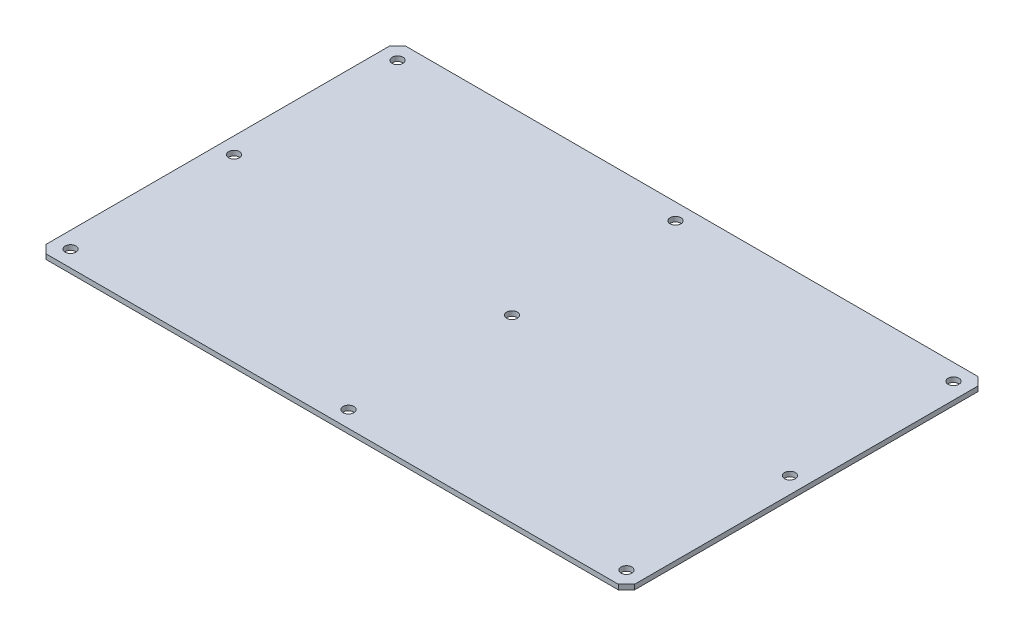
ISO-10303-21;
HEADER;
FILE_DESCRIPTION(('STEP AP214'),'2;1');
FILE_NAME('part.step','',(''),(''),'','','');
FILE_SCHEMA(('AUTOMOTIVE_DESIGN { 1 0 10303 214 1 1 1 1 }'));
ENDSEC;
DATA;
#1=APPLICATION_CONTEXT('core data for automotive mechanical design processes');
#2=APPLICATION_PROTOCOL_DEFINITION('international standard','automotive_design',2000,#1);
#3=PRODUCT_CONTEXT('',#1,'mechanical');
#4=PRODUCT('Part','Part','',(#3));
#5=PRODUCT_RELATED_PRODUCT_CATEGORY('part','',(#4));
#6=PRODUCT_DEFINITION_FORMATION('','',#4);
#7=PRODUCT_DEFINITION_CONTEXT('part definition',#1,'design');
#8=PRODUCT_DEFINITION('design','',#6,#7);
#9=PRODUCT_DEFINITION_SHAPE('','',#8);
#10=(LENGTH_UNIT() NAMED_UNIT(*) SI_UNIT(.MILLI.,.METRE.));
#11=(NAMED_UNIT(*) PLANE_ANGLE_UNIT() SI_UNIT($,.RADIAN.));
#12=(NAMED_UNIT(*) SI_UNIT($,.STERADIAN.) SOLID_ANGLE_UNIT());
#13=UNCERTAINTY_MEASURE_WITH_UNIT(LENGTH_MEASURE(1.E-05),#10,'distance_accuracy_value','');
#14=(GEOMETRIC_REPRESENTATION_CONTEXT(3) GLOBAL_UNCERTAINTY_ASSIGNED_CONTEXT((#13)) GLOBAL_UNIT_ASSIGNED_CONTEXT((#10,
#11,#12)) REPRESENTATION_CONTEXT('',''));
#15=CARTESIAN_POINT('',(0.,0.,0.));
#16=DIRECTION('',(0.,0.,1.));
#17=DIRECTION('',(1.,0.,0.));
#18=AXIS2_PLACEMENT_3D('',#15,#16,#17);
#19=CARTESIAN_POINT('',(180.,3.,-110.));
#20=DIRECTION('',(-1.,0.,0.));
#21=DIRECTION('',(0.,0.,1.));
#22=AXIS2_PLACEMENT_3D('',#19,#20,#21);
#23=PLANE('',#22);
#24=DIRECTION('',(0.,0.,-1.));
#25=VECTOR('',#24,1.);
#26=CARTESIAN_POINT('',(180.,3.,-110.));
#27=LINE('',#26,#25);
#28=CARTESIAN_POINT('',(180.,3.,105.));
#29=VERTEX_POINT('',#28);
#30=CARTESIAN_POINT('',(180.,3.,-105.));
#31=VERTEX_POINT('',#30);
#32=EDGE_CURVE('E126',#29,#31,#27,.T.);
#33=ORIENTED_EDGE('',*,*,#32,.F.);
#34=DIRECTION('',(0.,-1.,0.));
#35=VECTOR('',#34,1.);
#36=CARTESIAN_POINT('',(180.,3.,105.));
#37=LINE('',#36,#35);
#38=CARTESIAN_POINT('',(180.,0.,105.));
#39=VERTEX_POINT('',#38);
#40=EDGE_CURVE('E152',#29,#39,#37,.T.);
#41=ORIENTED_EDGE('',*,*,#40,.T.);
#42=DIRECTION('',(0.,0.,-1.));
#43=VECTOR('',#42,1.);
#44=CARTESIAN_POINT('',(180.,0.,-110.));
#45=LINE('',#44,#43);
#46=CARTESIAN_POINT('',(180.,0.,-105.));
#47=VERTEX_POINT('',#46);
#48=EDGE_CURVE('E158',#39,#47,#45,.T.);
#49=ORIENTED_EDGE('',*,*,#48,.T.);
#50=DIRECTION('',(0.,1.,0.));
#51=VECTOR('',#50,1.);
#52=CARTESIAN_POINT('',(180.,3.,-105.));
#53=LINE('',#52,#51);
#54=EDGE_CURVE('E150',#47,#31,#53,.T.);
#55=ORIENTED_EDGE('',*,*,#54,.T.);
#56=EDGE_LOOP('',(#33,#41,#49,#55));
#57=FACE_BOUND('',#56,.T.);
#58=ADVANCED_FACE('F34',(#57),#23,.F.);
#59=CARTESIAN_POINT('',(180.,3.,-110.));
#60=DIRECTION('',(0.,0.,1.));
#61=DIRECTION('',(1.,0.,0.));
#62=AXIS2_PLACEMENT_3D('',#59,#60,#61);
#63=PLANE('',#62);
#64=DIRECTION('',(-1.,0.,0.));
#65=VECTOR('',#64,1.);
#66=CARTESIAN_POINT('',(180.,3.,-110.));
#67=LINE('',#66,#65);
#68=CARTESIAN_POINT('',(175.,3.,-110.));
#69=VERTEX_POINT('',#68);
#70=CARTESIAN_POINT('',(-175.,3.,-110.));
#71=VERTEX_POINT('',#70);
#72=EDGE_CURVE('E129',#69,#71,#67,.T.);
#73=ORIENTED_EDGE('',*,*,#72,.F.);
#74=DIRECTION('',(0.,-1.,0.));
#75=VECTOR('',#74,1.);
#76=CARTESIAN_POINT('',(175.,3.,-110.));
#77=LINE('',#76,#75);
#78=CARTESIAN_POINT('',(175.,0.,-110.));
#79=VERTEX_POINT('',#78);
#80=EDGE_CURVE('E11',#69,#79,#77,.T.);
#81=ORIENTED_EDGE('',*,*,#80,.T.);
#82=DIRECTION('',(-1.,0.,0.));
#83=VECTOR('',#82,1.);
#84=CARTESIAN_POINT('',(180.,0.,-110.));
#85=LINE('',#84,#83);
#86=CARTESIAN_POINT('',(-175.,0.,-110.));
#87=VERTEX_POINT('',#86);
#88=EDGE_CURVE('E131',#79,#87,#85,.T.);
#89=ORIENTED_EDGE('',*,*,#88,.T.);
#90=DIRECTION('',(0.,1.,0.));
#91=VECTOR('',#90,1.);
#92=CARTESIAN_POINT('',(-175.,3.,-110.));
#93=LINE('',#92,#91);
#94=EDGE_CURVE('E42',#87,#71,#93,.T.);
#95=ORIENTED_EDGE('',*,*,#94,.T.);
#96=EDGE_LOOP('',(#73,#81,#89,#95));
#97=FACE_BOUND('',#96,.T.);
#98=ADVANCED_FACE('F261',(#97),#63,.F.);
#99=CARTESIAN_POINT('',(-180.,3.,-110.));
#100=DIRECTION('',(1.,0.,0.));
#101=DIRECTION('',(0.,0.,-1.));
#102=AXIS2_PLACEMENT_3D('',#99,#100,#101);
#103=PLANE('',#102);
#104=DIRECTION('',(0.,0.,1.));
#105=VECTOR('',#104,1.);
#106=CARTESIAN_POINT('',(-180.,0.,-110.));
#107=LINE('',#106,#105);
#108=CARTESIAN_POINT('',(-180.,0.,-105.));
#109=VERTEX_POINT('',#108);
#110=CARTESIAN_POINT('',(-180.,0.,105.));
#111=VERTEX_POINT('',#110);
#112=EDGE_CURVE('E127',#109,#111,#107,.T.);
#113=ORIENTED_EDGE('',*,*,#112,.T.);
#114=DIRECTION('',(0.,1.,0.));
#115=VECTOR('',#114,1.);
#116=CARTESIAN_POINT('',(-180.,3.,105.));
#117=LINE('',#116,#115);
#118=CARTESIAN_POINT('',(-180.,3.,105.));
#119=VERTEX_POINT('',#118);
#120=EDGE_CURVE('E105',#111,#119,#117,.T.);
#121=ORIENTED_EDGE('',*,*,#120,.T.);
#122=DIRECTION('',(0.,0.,1.));
#123=VECTOR('',#122,1.);
#124=CARTESIAN_POINT('',(-180.,3.,-110.));
#125=LINE('',#124,#123);
#126=CARTESIAN_POINT('',(-180.,3.,-105.));
#127=VERTEX_POINT('',#126);
#128=EDGE_CURVE('E170',#127,#119,#125,.T.);
#129=ORIENTED_EDGE('',*,*,#128,.F.);
#130=DIRECTION('',(0.,-1.,0.));
#131=VECTOR('',#130,1.);
#132=CARTESIAN_POINT('',(-180.,3.,-105.));
#133=LINE('',#132,#131);
#134=EDGE_CURVE('E110',#127,#109,#133,.T.);
#135=ORIENTED_EDGE('',*,*,#134,.T.);
#136=EDGE_LOOP('',(#113,#121,#129,#135));
#137=FACE_BOUND('',#136,.T.);
#138=ADVANCED_FACE('F266',(#137),#103,.F.);
#139=CARTESIAN_POINT('',(180.,3.,110.));
#140=DIRECTION('',(0.,0.,-1.));
#141=DIRECTION('',(-1.,0.,0.));
#142=AXIS2_PLACEMENT_3D('',#139,#140,#141);
#143=PLANE('',#142);
#144=DIRECTION('',(1.,0.,0.));
#145=VECTOR('',#144,1.);
#146=CARTESIAN_POINT('',(180.,3.,110.));
#147=LINE('',#146,#145);
#148=CARTESIAN_POINT('',(-175.,3.,110.));
#149=VERTEX_POINT('',#148);
#150=CARTESIAN_POINT('',(175.,3.,110.));
#151=VERTEX_POINT('',#150);
#152=EDGE_CURVE('E120',#149,#151,#147,.T.);
#153=ORIENTED_EDGE('',*,*,#152,.F.);
#154=DIRECTION('',(0.,-1.,0.));
#155=VECTOR('',#154,1.);
#156=CARTESIAN_POINT('',(-175.,3.,110.));
#157=LINE('',#156,#155);
#158=CARTESIAN_POINT('',(-175.,0.,110.));
#159=VERTEX_POINT('',#158);
#160=EDGE_CURVE('E104',#149,#159,#157,.T.);
#161=ORIENTED_EDGE('',*,*,#160,.T.);
#162=DIRECTION('',(1.,0.,0.));
#163=VECTOR('',#162,1.);
#164=CARTESIAN_POINT('',(180.,0.,110.));
#165=LINE('',#164,#163);
#166=CARTESIAN_POINT('',(175.,0.,110.));
#167=VERTEX_POINT('',#166);
#168=EDGE_CURVE('E117',#159,#167,#165,.T.);
#169=ORIENTED_EDGE('',*,*,#168,.T.);
#170=DIRECTION('',(0.,1.,0.));
#171=VECTOR('',#170,1.);
#172=CARTESIAN_POINT('',(175.,3.,110.));
#173=LINE('',#172,#171);
#174=EDGE_CURVE('E122',#167,#151,#173,.T.);
#175=ORIENTED_EDGE('',*,*,#174,.T.);
#176=EDGE_LOOP('',(#153,#161,#169,#175));
#177=FACE_BOUND('',#176,.T.);
#178=ADVANCED_FACE('F116',(#177),#143,.F.);
#179=CARTESIAN_POINT('',(0.,3.,0.));
#180=DIRECTION('',(0.,-1.,0.));
#181=DIRECTION('',(0.,0.,-1.));
#182=AXIS2_PLACEMENT_3D('',#179,#180,#181);
#183=PLANE('',#182);
#184=CARTESIAN_POINT('',(170.,3.,-99.9999999999976));
#185=DIRECTION('',(0.,-1.,0.));
#186=DIRECTION('',(0.,0.,-1.));
#187=AXIS2_PLACEMENT_3D('',#184,#185,#186);
#188=CIRCLE('',#187,3.3);
#189=CARTESIAN_POINT('',(170.,3.,-103.299999999998));
#190=VERTEX_POINT('',#189);
#191=EDGE_CURVE('E218',#190,#190,#188,.T.);
#192=ORIENTED_EDGE('',*,*,#191,.T.);
#193=EDGE_LOOP('',(#192));
#194=FACE_BOUND('',#193,.T.);
#195=CARTESIAN_POINT('',(0.,3.,-100.));
#196=DIRECTION('',(0.,-1.,0.));
#197=DIRECTION('',(0.,0.,-1.));
#198=AXIS2_PLACEMENT_3D('',#195,#196,#197);
#199=CIRCLE('',#198,3.3);
#200=CARTESIAN_POINT('',(0.,3.,-103.3));
#201=VERTEX_POINT('',#200);
#202=EDGE_CURVE('E212',#201,#201,#199,.T.);
#203=ORIENTED_EDGE('',*,*,#202,.T.);
#204=EDGE_LOOP('',(#203));
#205=FACE_BOUND('',#204,.T.);
#206=CARTESIAN_POINT('',(-170.,3.,-100.000000000002));
#207=DIRECTION('',(0.,-1.,0.));
#208=DIRECTION('',(0.,0.,-1.));
#209=AXIS2_PLACEMENT_3D('',#206,#207,#208);
#210=CIRCLE('',#209,3.3);
#211=CARTESIAN_POINT('',(-170.,3.,-103.300000000002));
#212=VERTEX_POINT('',#211);
#213=EDGE_CURVE('E206',#212,#212,#210,.T.);
#214=ORIENTED_EDGE('',*,*,#213,.T.);
#215=EDGE_LOOP('',(#214));
#216=FACE_BOUND('',#215,.T.);
#217=CARTESIAN_POINT('',(0.,3.,0.));
#218=DIRECTION('',(0.,-1.,0.));
#219=DIRECTION('',(0.,0.,-1.));
#220=AXIS2_PLACEMENT_3D('',#217,#218,#219);
#221=CIRCLE('',#220,3.3);
#222=CARTESIAN_POINT('',(0.,3.,-3.3));
#223=VERTEX_POINT('',#222);
#224=EDGE_CURVE('E200',#223,#223,#221,.T.);
#225=ORIENTED_EDGE('',*,*,#224,.T.);
#226=EDGE_LOOP('',(#225));
#227=FACE_BOUND('',#226,.T.);
#228=CARTESIAN_POINT('',(-170.,3.,-2.37310171513627E-12));
#229=DIRECTION('',(0.,-1.,0.));
#230=DIRECTION('',(0.,0.,-1.));
#231=AXIS2_PLACEMENT_3D('',#228,#229,#230);
#232=CIRCLE('',#231,3.3);
#233=CARTESIAN_POINT('',(-170.,3.,-3.30000000000237));
#234=VERTEX_POINT('',#233);
#235=EDGE_CURVE('E194',#234,#234,#232,.T.);
#236=ORIENTED_EDGE('',*,*,#235,.T.);
#237=EDGE_LOOP('',(#236));
#238=FACE_BOUND('',#237,.T.);
#239=CARTESIAN_POINT('',(0.,3.,100.));
#240=DIRECTION('',(0.,-1.,0.));
#241=DIRECTION('',(0.,0.,-1.));
#242=AXIS2_PLACEMENT_3D('',#239,#240,#241);
#243=CIRCLE('',#242,3.3);
#244=CARTESIAN_POINT('',(0.,3.,96.7));
#245=VERTEX_POINT('',#244);
#246=EDGE_CURVE('E188',#245,#245,#243,.T.);
#247=ORIENTED_EDGE('',*,*,#246,.T.);
#248=EDGE_LOOP('',(#247));
#249=FACE_BOUND('',#248,.T.);
#250=CARTESIAN_POINT('',(-170.,3.,99.9999999999976));
#251=DIRECTION('',(0.,-1.,0.));
#252=DIRECTION('',(0.,0.,-1.));
#253=AXIS2_PLACEMENT_3D('',#250,#251,#252);
#254=CIRCLE('',#253,3.3);
#255=CARTESIAN_POINT('',(-170.,3.,96.6999999999976));
#256=VERTEX_POINT('',#255);
#257=EDGE_CURVE('E182',#256,#256,#254,.T.);
#258=ORIENTED_EDGE('',*,*,#257,.T.);
#259=EDGE_LOOP('',(#258));
#260=FACE_BOUND('',#259,.T.);
#261=CARTESIAN_POINT('',(170.,3.,2.37310171513627E-12));
#262=DIRECTION('',(0.,-1.,0.));
#263=DIRECTION('',(0.,0.,-1.));
#264=AXIS2_PLACEMENT_3D('',#261,#262,#263);
#265=CIRCLE('',#264,3.3);
#266=CARTESIAN_POINT('',(170.,3.,-3.29999999999762));
#267=VERTEX_POINT('',#266);
#268=EDGE_CURVE('E176',#267,#267,#265,.T.);
#269=ORIENTED_EDGE('',*,*,#268,.T.);
#270=EDGE_LOOP('',(#269));
#271=FACE_BOUND('',#270,.T.);
#272=CARTESIAN_POINT('',(170.,3.,100.000000000002));
#273=DIRECTION('',(0.,-1.,0.));
#274=DIRECTION('',(0.,0.,-1.));
#275=AXIS2_PLACEMENT_3D('',#272,#273,#274);
#276=CIRCLE('',#275,3.3);
#277=CARTESIAN_POINT('',(170.,3.,96.7000000000024));
#278=VERTEX_POINT('',#277);
#279=EDGE_CURVE('E163',#278,#278,#276,.T.);
#280=ORIENTED_EDGE('',*,*,#279,.T.);
#281=EDGE_LOOP('',(#280));
#282=FACE_BOUND('',#281,.T.);
#283=ORIENTED_EDGE('',*,*,#128,.T.);
#284=DIRECTION('',(-0.707106781186544,0.,-0.707106781186551));
#285=VECTOR('',#284,1.);
#286=CARTESIAN_POINT('',(-175.,3.,110.));
#287=LINE('',#286,#285);
#288=EDGE_CURVE('E148',#119,#149,#287,.F.);
#289=ORIENTED_EDGE('',*,*,#288,.T.);
#290=ORIENTED_EDGE('',*,*,#152,.T.);
#291=DIRECTION('',(-0.707106781186548,0.,0.707106781186548));
#292=VECTOR('',#291,1.);
#293=CARTESIAN_POINT('',(180.,3.,105.));
#294=LINE('',#293,#292);
#295=EDGE_CURVE('E146',#151,#29,#294,.F.);
#296=ORIENTED_EDGE('',*,*,#295,.T.);
#297=ORIENTED_EDGE('',*,*,#32,.T.);
#298=DIRECTION('',(0.707106781186544,0.,0.707106781186551));
#299=VECTOR('',#298,1.);
#300=CARTESIAN_POINT('',(175.,3.,-110.));
#301=LINE('',#300,#299);
#302=EDGE_CURVE('E55',#31,#69,#301,.F.);
#303=ORIENTED_EDGE('',*,*,#302,.T.);
#304=ORIENTED_EDGE('',*,*,#72,.T.);
#305=DIRECTION('',(0.707106781186548,0.,-0.707106781186548));
#306=VECTOR('',#305,1.);
#307=CARTESIAN_POINT('',(-180.,3.,-105.));
#308=LINE('',#307,#306);
#309=EDGE_CURVE('E143',#71,#127,#308,.F.);
#310=ORIENTED_EDGE('',*,*,#309,.T.);
#311=EDGE_LOOP('',(#283,#289,#290,#296,#297,#303,#304,#310));
#312=FACE_BOUND('',#311,.T.);
#313=ADVANCED_FACE('F230',(#194,#205,#216,#227,#238,#249,#260,#271,#282,#312),#183,.F.);
#314=CARTESIAN_POINT('',(0.,0.,0.));
#315=DIRECTION('',(0.,-1.,0.));
#316=DIRECTION('',(0.,0.,-1.));
#317=AXIS2_PLACEMENT_3D('',#314,#315,#316);
#318=PLANE('',#317);
#319=CARTESIAN_POINT('',(170.,0.,-99.9999999999976));
#320=DIRECTION('',(0.,-1.,0.));
#321=DIRECTION('',(0.,0.,-1.));
#322=AXIS2_PLACEMENT_3D('',#319,#320,#321);
#323=CIRCLE('',#322,3.3);
#324=CARTESIAN_POINT('',(170.,0.,-103.299999999998));
#325=VERTEX_POINT('',#324);
#326=EDGE_CURVE('E221',#325,#325,#323,.T.);
#327=ORIENTED_EDGE('',*,*,#326,.F.);
#328=EDGE_LOOP('',(#327));
#329=FACE_BOUND('',#328,.T.);
#330=CARTESIAN_POINT('',(0.,0.,-100.));
#331=DIRECTION('',(0.,-1.,0.));
#332=DIRECTION('',(0.,0.,-1.));
#333=AXIS2_PLACEMENT_3D('',#330,#331,#332);
#334=CIRCLE('',#333,3.29999999999999);
#335=CARTESIAN_POINT('',(0.,0.,-103.3));
#336=VERTEX_POINT('',#335);
#337=EDGE_CURVE('E215',#336,#336,#334,.T.);
#338=ORIENTED_EDGE('',*,*,#337,.F.);
#339=EDGE_LOOP('',(#338));
#340=FACE_BOUND('',#339,.T.);
#341=CARTESIAN_POINT('',(-170.,0.,-100.000000000002));
#342=DIRECTION('',(0.,-1.,0.));
#343=DIRECTION('',(0.,0.,-1.));
#344=AXIS2_PLACEMENT_3D('',#341,#342,#343);
#345=CIRCLE('',#344,3.3);
#346=CARTESIAN_POINT('',(-170.,0.,-103.300000000002));
#347=VERTEX_POINT('',#346);
#348=EDGE_CURVE('E209',#347,#347,#345,.T.);
#349=ORIENTED_EDGE('',*,*,#348,.F.);
#350=EDGE_LOOP('',(#349));
#351=FACE_BOUND('',#350,.T.);
#352=CARTESIAN_POINT('',(0.,0.,0.));
#353=DIRECTION('',(0.,-1.,0.));
#354=DIRECTION('',(0.,0.,-1.));
#355=AXIS2_PLACEMENT_3D('',#352,#353,#354);
#356=CIRCLE('',#355,3.29999999999999);
#357=CARTESIAN_POINT('',(0.,0.,-3.29999999999999));
#358=VERTEX_POINT('',#357);
#359=EDGE_CURVE('E203',#358,#358,#356,.T.);
#360=ORIENTED_EDGE('',*,*,#359,.F.);
#361=EDGE_LOOP('',(#360));
#362=FACE_BOUND('',#361,.T.);
#363=CARTESIAN_POINT('',(-170.,0.,-2.37310171513627E-12));
#364=DIRECTION('',(0.,-1.,0.));
#365=DIRECTION('',(0.,0.,-1.));
#366=AXIS2_PLACEMENT_3D('',#363,#364,#365);
#367=CIRCLE('',#366,3.3);
#368=CARTESIAN_POINT('',(-170.,0.,-3.30000000000237));
#369=VERTEX_POINT('',#368);
#370=EDGE_CURVE('E197',#369,#369,#367,.T.);
#371=ORIENTED_EDGE('',*,*,#370,.F.);
#372=EDGE_LOOP('',(#371));
#373=FACE_BOUND('',#372,.T.);
#374=CARTESIAN_POINT('',(0.,0.,100.));
#375=DIRECTION('',(0.,-1.,0.));
#376=DIRECTION('',(0.,0.,-1.));
#377=AXIS2_PLACEMENT_3D('',#374,#375,#376);
#378=CIRCLE('',#377,3.29999999999999);
#379=CARTESIAN_POINT('',(0.,0.,96.7));
#380=VERTEX_POINT('',#379);
#381=EDGE_CURVE('E191',#380,#380,#378,.T.);
#382=ORIENTED_EDGE('',*,*,#381,.F.);
#383=EDGE_LOOP('',(#382));
#384=FACE_BOUND('',#383,.T.);
#385=CARTESIAN_POINT('',(-170.,0.,99.9999999999976));
#386=DIRECTION('',(0.,-1.,0.));
#387=DIRECTION('',(0.,0.,-1.));
#388=AXIS2_PLACEMENT_3D('',#385,#386,#387);
#389=CIRCLE('',#388,3.3);
#390=CARTESIAN_POINT('',(-170.,0.,96.6999999999976));
#391=VERTEX_POINT('',#390);
#392=EDGE_CURVE('E185',#391,#391,#389,.T.);
#393=ORIENTED_EDGE('',*,*,#392,.F.);
#394=EDGE_LOOP('',(#393));
#395=FACE_BOUND('',#394,.T.);
#396=CARTESIAN_POINT('',(170.,0.,2.37310171513627E-12));
#397=DIRECTION('',(0.,-1.,0.));
#398=DIRECTION('',(0.,0.,-1.));
#399=AXIS2_PLACEMENT_3D('',#396,#397,#398);
#400=CIRCLE('',#399,3.3);
#401=CARTESIAN_POINT('',(170.,0.,-3.29999999999762));
#402=VERTEX_POINT('',#401);
#403=EDGE_CURVE('E179',#402,#402,#400,.T.);
#404=ORIENTED_EDGE('',*,*,#403,.F.);
#405=EDGE_LOOP('',(#404));
#406=FACE_BOUND('',#405,.T.);
#407=CARTESIAN_POINT('',(170.,0.,100.000000000002));
#408=DIRECTION('',(0.,-1.,0.));
#409=DIRECTION('',(0.,0.,-1.));
#410=AXIS2_PLACEMENT_3D('',#407,#408,#409);
#411=CIRCLE('',#410,3.3);
#412=CARTESIAN_POINT('',(170.,0.,96.7000000000024));
#413=VERTEX_POINT('',#412);
#414=EDGE_CURVE('E166',#413,#413,#411,.T.);
#415=ORIENTED_EDGE('',*,*,#414,.F.);
#416=EDGE_LOOP('',(#415));
#417=FACE_BOUND('',#416,.T.);
#418=ORIENTED_EDGE('',*,*,#168,.F.);
#419=DIRECTION('',(0.707106781186544,0.,0.707106781186551));
#420=VECTOR('',#419,1.);
#421=CARTESIAN_POINT('',(-142.500000000001,0.,142.499999999999));
#422=LINE('',#421,#420);
#423=EDGE_CURVE('E100',#159,#111,#422,.F.);
#424=ORIENTED_EDGE('',*,*,#423,.T.);
#425=ORIENTED_EDGE('',*,*,#112,.F.);
#426=DIRECTION('',(-0.707106781186548,0.,0.707106781186548));
#427=VECTOR('',#426,1.);
#428=CARTESIAN_POINT('',(-142.5,0.,-142.5));
#429=LINE('',#428,#427);
#430=EDGE_CURVE('E121',#109,#87,#429,.F.);
#431=ORIENTED_EDGE('',*,*,#430,.T.);
#432=ORIENTED_EDGE('',*,*,#88,.F.);
#433=DIRECTION('',(-0.707106781186544,0.,-0.707106781186551));
#434=VECTOR('',#433,1.);
#435=CARTESIAN_POINT('',(142.500000000001,0.,-142.499999999999));
#436=LINE('',#435,#434);
#437=EDGE_CURVE('E137',#79,#47,#436,.F.);
#438=ORIENTED_EDGE('',*,*,#437,.T.);
#439=ORIENTED_EDGE('',*,*,#48,.F.);
#440=DIRECTION('',(0.707106781186548,0.,-0.707106781186548));
#441=VECTOR('',#440,1.);
#442=CARTESIAN_POINT('',(142.5,0.,142.5));
#443=LINE('',#442,#441);
#444=EDGE_CURVE('E111',#39,#167,#443,.F.);
#445=ORIENTED_EDGE('',*,*,#444,.T.);
#446=EDGE_LOOP('',(#418,#424,#425,#431,#432,#438,#439,#445));
#447=FACE_BOUND('',#446,.T.);
#448=ADVANCED_FACE('F124',(#329,#340,#351,#362,#373,#384,#395,#406,#417,#447),#318,.T.);
#449=CARTESIAN_POINT('',(170.,0.,100.000000000002));
#450=DIRECTION('',(0.,-1.,0.));
#451=DIRECTION('',(0.,0.,-1.));
#452=AXIS2_PLACEMENT_3D('',#449,#450,#451);
#453=CYLINDRICAL_SURFACE('',#452,3.3);
#454=ORIENTED_EDGE('',*,*,#279,.F.);
#455=EDGE_LOOP('',(#454));
#456=FACE_BOUND('',#455,.T.);
#457=ORIENTED_EDGE('',*,*,#414,.T.);
#458=EDGE_LOOP('',(#457));
#459=FACE_BOUND('',#458,.T.);
#460=ADVANCED_FACE('F229',(#456,#459),#453,.F.);
#461=CARTESIAN_POINT('',(170.,0.,2.37310171513627E-12));
#462=DIRECTION('',(0.,-1.,0.));
#463=DIRECTION('',(0.,0.,-1.));
#464=AXIS2_PLACEMENT_3D('',#461,#462,#463);
#465=CYLINDRICAL_SURFACE('',#464,3.3);
#466=ORIENTED_EDGE('',*,*,#268,.F.);
#467=EDGE_LOOP('',(#466));
#468=FACE_BOUND('',#467,.T.);
#469=ORIENTED_EDGE('',*,*,#403,.T.);
#470=EDGE_LOOP('',(#469));
#471=FACE_BOUND('',#470,.T.);
#472=ADVANCED_FACE('F249',(#468,#471),#465,.F.);
#473=CARTESIAN_POINT('',(-170.,0.,99.9999999999976));
#474=DIRECTION('',(0.,-1.,0.));
#475=DIRECTION('',(0.,0.,-1.));
#476=AXIS2_PLACEMENT_3D('',#473,#474,#475);
#477=CYLINDRICAL_SURFACE('',#476,3.3);
#478=ORIENTED_EDGE('',*,*,#257,.F.);
#479=EDGE_LOOP('',(#478));
#480=FACE_BOUND('',#479,.T.);
#481=ORIENTED_EDGE('',*,*,#392,.T.);
#482=EDGE_LOOP('',(#481));
#483=FACE_BOUND('',#482,.T.);
#484=ADVANCED_FACE('F255',(#480,#483),#477,.F.);
#485=CARTESIAN_POINT('',(0.,0.,100.));
#486=DIRECTION('',(0.,-1.,0.));
#487=DIRECTION('',(0.,0.,-1.));
#488=AXIS2_PLACEMENT_3D('',#485,#486,#487);
#489=CYLINDRICAL_SURFACE('',#488,3.29999999999999);
#490=ORIENTED_EDGE('',*,*,#246,.F.);
#491=EDGE_LOOP('',(#490));
#492=FACE_BOUND('',#491,.T.);
#493=ORIENTED_EDGE('',*,*,#381,.T.);
#494=EDGE_LOOP('',(#493));
#495=FACE_BOUND('',#494,.T.);
#496=ADVANCED_FACE('F375',(#492,#495),#489,.F.);
#497=CARTESIAN_POINT('',(-170.,0.,-2.37310171513627E-12));
#498=DIRECTION('',(0.,-1.,0.));
#499=DIRECTION('',(0.,0.,-1.));
#500=AXIS2_PLACEMENT_3D('',#497,#498,#499);
#501=CYLINDRICAL_SURFACE('',#500,3.3);
#502=ORIENTED_EDGE('',*,*,#235,.F.);
#503=EDGE_LOOP('',(#502));
#504=FACE_BOUND('',#503,.T.);
#505=ORIENTED_EDGE('',*,*,#370,.T.);
#506=EDGE_LOOP('',(#505));
#507=FACE_BOUND('',#506,.T.);
#508=ADVANCED_FACE('F367',(#504,#507),#501,.F.);
#509=CARTESIAN_POINT('',(0.,0.,0.));
#510=DIRECTION('',(0.,-1.,0.));
#511=DIRECTION('',(0.,0.,-1.));
#512=AXIS2_PLACEMENT_3D('',#509,#510,#511);
#513=CYLINDRICAL_SURFACE('',#512,3.29999999999999);
#514=ORIENTED_EDGE('',*,*,#224,.F.);
#515=EDGE_LOOP('',(#514));
#516=FACE_BOUND('',#515,.T.);
#517=ORIENTED_EDGE('',*,*,#359,.T.);
#518=EDGE_LOOP('',(#517));
#519=FACE_BOUND('',#518,.T.);
#520=ADVANCED_FACE('F359',(#516,#519),#513,.F.);
#521=CARTESIAN_POINT('',(-170.,0.,-100.000000000002));
#522=DIRECTION('',(0.,-1.,0.));
#523=DIRECTION('',(0.,0.,-1.));
#524=AXIS2_PLACEMENT_3D('',#521,#522,#523);
#525=CYLINDRICAL_SURFACE('',#524,3.3);
#526=ORIENTED_EDGE('',*,*,#213,.F.);
#527=EDGE_LOOP('',(#526));
#528=FACE_BOUND('',#527,.T.);
#529=ORIENTED_EDGE('',*,*,#348,.T.);
#530=EDGE_LOOP('',(#529));
#531=FACE_BOUND('',#530,.T.);
#532=ADVANCED_FACE('F351',(#528,#531),#525,.F.);
#533=CARTESIAN_POINT('',(0.,0.,-100.));
#534=DIRECTION('',(0.,-1.,0.));
#535=DIRECTION('',(0.,0.,-1.));
#536=AXIS2_PLACEMENT_3D('',#533,#534,#535);
#537=CYLINDRICAL_SURFACE('',#536,3.29999999999999);
#538=ORIENTED_EDGE('',*,*,#202,.F.);
#539=EDGE_LOOP('',(#538));
#540=FACE_BOUND('',#539,.T.);
#541=ORIENTED_EDGE('',*,*,#337,.T.);
#542=EDGE_LOOP('',(#541));
#543=FACE_BOUND('',#542,.T.);
#544=ADVANCED_FACE('F344',(#540,#543),#537,.F.);
#545=CARTESIAN_POINT('',(170.,0.,-99.9999999999976));
#546=DIRECTION('',(0.,-1.,0.));
#547=DIRECTION('',(0.,0.,-1.));
#548=AXIS2_PLACEMENT_3D('',#545,#546,#547);
#549=CYLINDRICAL_SURFACE('',#548,3.3);
#550=ORIENTED_EDGE('',*,*,#191,.F.);
#551=EDGE_LOOP('',(#550));
#552=FACE_BOUND('',#551,.T.);
#553=ORIENTED_EDGE('',*,*,#326,.T.);
#554=EDGE_LOOP('',(#553));
#555=FACE_BOUND('',#554,.T.);
#556=ADVANCED_FACE('F225',(#552,#555),#549,.F.);
#557=CARTESIAN_POINT('',(-175.,3.,110.));
#558=DIRECTION('',(0.707106781186551,0.,-0.707106781186544));
#559=DIRECTION('',(0.,-1.,0.));
#560=AXIS2_PLACEMENT_3D('',#557,#558,#559);
#561=PLANE('',#560);
#562=ORIENTED_EDGE('',*,*,#288,.F.);
#563=ORIENTED_EDGE('',*,*,#120,.F.);
#564=ORIENTED_EDGE('',*,*,#423,.F.);
#565=ORIENTED_EDGE('',*,*,#160,.F.);
#566=EDGE_LOOP('',(#562,#563,#564,#565));
#567=FACE_BOUND('',#566,.T.);
#568=ADVANCED_FACE('F103',(#567),#561,.F.);
#569=CARTESIAN_POINT('',(180.,3.,105.));
#570=DIRECTION('',(-0.707106781186547,0.,-0.707106781186547));
#571=DIRECTION('',(0.,-1.,0.));
#572=AXIS2_PLACEMENT_3D('',#569,#570,#571);
#573=PLANE('',#572);
#574=ORIENTED_EDGE('',*,*,#295,.F.);
#575=ORIENTED_EDGE('',*,*,#174,.F.);
#576=ORIENTED_EDGE('',*,*,#444,.F.);
#577=ORIENTED_EDGE('',*,*,#40,.F.);
#578=EDGE_LOOP('',(#574,#575,#576,#577));
#579=FACE_BOUND('',#578,.T.);
#580=ADVANCED_FACE('F272',(#579),#573,.F.);
#581=CARTESIAN_POINT('',(175.,3.,-110.));
#582=DIRECTION('',(-0.707106781186551,0.,0.707106781186544));
#583=DIRECTION('',(0.,-1.,0.));
#584=AXIS2_PLACEMENT_3D('',#581,#582,#583);
#585=PLANE('',#584);
#586=ORIENTED_EDGE('',*,*,#302,.F.);
#587=ORIENTED_EDGE('',*,*,#54,.F.);
#588=ORIENTED_EDGE('',*,*,#437,.F.);
#589=ORIENTED_EDGE('',*,*,#80,.F.);
#590=EDGE_LOOP('',(#586,#587,#588,#589));
#591=FACE_BOUND('',#590,.T.);
#592=ADVANCED_FACE('F274',(#591),#585,.F.);
#593=CARTESIAN_POINT('',(-180.,3.,-105.));
#594=DIRECTION('',(0.707106781186547,0.,0.707106781186547));
#595=DIRECTION('',(0.,-1.,0.));
#596=AXIS2_PLACEMENT_3D('',#593,#594,#595);
#597=PLANE('',#596);
#598=ORIENTED_EDGE('',*,*,#309,.F.);
#599=ORIENTED_EDGE('',*,*,#94,.F.);
#600=ORIENTED_EDGE('',*,*,#430,.F.);
#601=ORIENTED_EDGE('',*,*,#134,.F.);
#602=EDGE_LOOP('',(#598,#599,#600,#601));
#603=FACE_BOUND('',#602,.T.);
#604=ADVANCED_FACE('F36',(#603),#597,.F.);
#605=CLOSED_SHELL('',(#58,#98,#138,#178,#313,#448,#460,#472,#484,#496,#508,#520,#532,#544,#556,
#568,#580,#592,#604));
#606=MANIFOLD_SOLID_BREP('B2',#605);
#607=ADVANCED_BREP_SHAPE_REPRESENTATION('',(#18,#606),#14);
#608=SHAPE_DEFINITION_REPRESENTATION(#9,#607);
ENDSEC;
END-ISO-10303-21;
